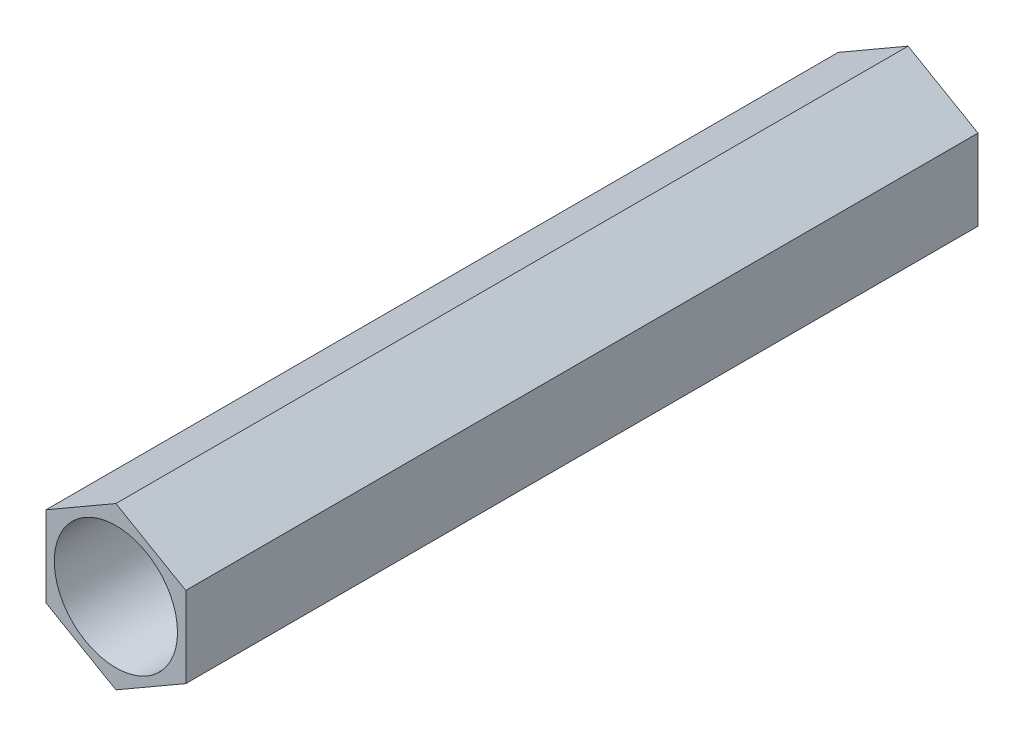
ISO-10303-21;
HEADER;
FILE_DESCRIPTION(('STEP AP214'),'2;1');
FILE_NAME('part.step','',(''),(''),'','','');
FILE_SCHEMA(('AUTOMOTIVE_DESIGN { 1 0 10303 214 1 1 1 1 }'));
ENDSEC;
DATA;
#1=APPLICATION_CONTEXT('core data for automotive mechanical design processes');
#2=APPLICATION_PROTOCOL_DEFINITION('international standard','automotive_design',2000,#1);
#3=PRODUCT_CONTEXT('',#1,'mechanical');
#4=PRODUCT('Part','Part','',(#3));
#5=PRODUCT_RELATED_PRODUCT_CATEGORY('part','',(#4));
#6=PRODUCT_DEFINITION_FORMATION('','',#4);
#7=PRODUCT_DEFINITION_CONTEXT('part definition',#1,'design');
#8=PRODUCT_DEFINITION('design','',#6,#7);
#9=PRODUCT_DEFINITION_SHAPE('','',#8);
#10=(LENGTH_UNIT() NAMED_UNIT(*) SI_UNIT(.MILLI.,.METRE.));
#11=(NAMED_UNIT(*) PLANE_ANGLE_UNIT() SI_UNIT($,.RADIAN.));
#12=(NAMED_UNIT(*) SI_UNIT($,.STERADIAN.) SOLID_ANGLE_UNIT());
#13=UNCERTAINTY_MEASURE_WITH_UNIT(LENGTH_MEASURE(1.E-05),#10,'distance_accuracy_value','');
#14=(GEOMETRIC_REPRESENTATION_CONTEXT(3) GLOBAL_UNCERTAINTY_ASSIGNED_CONTEXT((#13)) GLOBAL_UNIT_ASSIGNED_CONTEXT((#10,
#11,#12)) REPRESENTATION_CONTEXT('',''));
#15=CARTESIAN_POINT('',(0.,0.,0.));
#16=DIRECTION('',(0.,0.,1.));
#17=DIRECTION('',(1.,0.,0.));
#18=AXIS2_PLACEMENT_3D('',#15,#16,#17);
#19=CARTESIAN_POINT('',(0.,-2.75,27.));
#20=DIRECTION('',(0.,0.,1.));
#21=DIRECTION('',(1.,0.,0.));
#22=AXIS2_PLACEMENT_3D('',#19,#20,#21);
#23=PLANE('',#22);
#24=DIRECTION('',(0.866025403784438,-0.500000000000001,0.));
#25=VECTOR('',#24,1.);
#26=CARTESIAN_POINT('',(-2.38156986040721,-1.375,27.));
#27=LINE('',#26,#25);
#28=CARTESIAN_POINT('',(-2.38156986040721,-1.375,27.));
#29=VERTEX_POINT('',#28);
#30=CARTESIAN_POINT('',(0.,-2.75,27.));
#31=VERTEX_POINT('',#30);
#32=EDGE_CURVE('E128',#29,#31,#27,.T.);
#33=ORIENTED_EDGE('',*,*,#32,.T.);
#34=DIRECTION('',(0.866025403784439,0.5,0.));
#35=VECTOR('',#34,1.);
#36=CARTESIAN_POINT('',(0.,-2.75,27.));
#37=LINE('',#36,#35);
#38=CARTESIAN_POINT('',(2.3815698604072,-1.375,27.));
#39=VERTEX_POINT('',#38);
#40=EDGE_CURVE('E86',#31,#39,#37,.T.);
#41=ORIENTED_EDGE('',*,*,#40,.T.);
#42=DIRECTION('',(0.,1.,0.));
#43=VECTOR('',#42,1.);
#44=CARTESIAN_POINT('',(2.3815698604072,-1.375,27.));
#45=LINE('',#44,#43);
#46=CARTESIAN_POINT('',(2.3815698604072,1.375,27.));
#47=VERTEX_POINT('',#46);
#48=EDGE_CURVE('E99',#39,#47,#45,.T.);
#49=ORIENTED_EDGE('',*,*,#48,.T.);
#50=DIRECTION('',(-0.866025403784439,0.5,0.));
#51=VECTOR('',#50,1.);
#52=CARTESIAN_POINT('',(2.3815698604072,1.375,27.));
#53=LINE('',#52,#51);
#54=CARTESIAN_POINT('',(0.,2.75,27.));
#55=VERTEX_POINT('',#54);
#56=EDGE_CURVE('E93',#47,#55,#53,.T.);
#57=ORIENTED_EDGE('',*,*,#56,.T.);
#58=DIRECTION('',(-0.866025403784439,-0.499999999999999,0.));
#59=VECTOR('',#58,1.);
#60=CARTESIAN_POINT('',(0.,2.75,27.));
#61=LINE('',#60,#59);
#62=CARTESIAN_POINT('',(-2.3815698604072,1.375,27.));
#63=VERTEX_POINT('',#62);
#64=EDGE_CURVE('E97',#55,#63,#61,.T.);
#65=ORIENTED_EDGE('',*,*,#64,.T.);
#66=DIRECTION('',(0.,-1.,0.));
#67=VECTOR('',#66,1.);
#68=CARTESIAN_POINT('',(-2.3815698604072,1.375,27.));
#69=LINE('',#68,#67);
#70=EDGE_CURVE('E49',#63,#29,#69,.T.);
#71=ORIENTED_EDGE('',*,*,#70,.T.);
#72=EDGE_LOOP('',(#33,#41,#49,#57,#65,#71));
#73=FACE_BOUND('',#72,.T.);
#74=CARTESIAN_POINT('',(0.,0.,27.));
#75=DIRECTION('',(0.,0.,1.));
#76=DIRECTION('',(1.,0.,0.));
#77=AXIS2_PLACEMENT_3D('',#74,#75,#76);
#78=CIRCLE('',#77,2.1);
#79=CARTESIAN_POINT('',(2.1,0.,27.));
#80=VERTEX_POINT('',#79);
#81=EDGE_CURVE('E121',#80,#80,#78,.T.);
#82=ORIENTED_EDGE('',*,*,#81,.F.);
#83=EDGE_LOOP('',(#82));
#84=FACE_BOUND('',#83,.T.);
#85=ADVANCED_FACE('F32',(#73,#84),#23,.T.);
#86=CARTESIAN_POINT('',(0.,-2.75,0.));
#87=DIRECTION('',(0.,0.,1.));
#88=DIRECTION('',(1.,0.,0.));
#89=AXIS2_PLACEMENT_3D('',#86,#87,#88);
#90=PLANE('',#89);
#91=DIRECTION('',(0.866025403784438,-0.500000000000001,0.));
#92=VECTOR('',#91,1.);
#93=CARTESIAN_POINT('',(-2.38156986040721,-1.375,0.));
#94=LINE('',#93,#92);
#95=CARTESIAN_POINT('',(-2.38156986040721,-1.375,0.));
#96=VERTEX_POINT('',#95);
#97=CARTESIAN_POINT('',(0.,-2.75,0.));
#98=VERTEX_POINT('',#97);
#99=EDGE_CURVE('E117',#96,#98,#94,.T.);
#100=ORIENTED_EDGE('',*,*,#99,.F.);
#101=DIRECTION('',(0.,-1.,0.));
#102=VECTOR('',#101,1.);
#103=CARTESIAN_POINT('',(-2.3815698604072,1.375,0.));
#104=LINE('',#103,#102);
#105=CARTESIAN_POINT('',(-2.3815698604072,1.375,0.));
#106=VERTEX_POINT('',#105);
#107=EDGE_CURVE('E78',#106,#96,#104,.T.);
#108=ORIENTED_EDGE('',*,*,#107,.F.);
#109=DIRECTION('',(-0.866025403784439,-0.499999999999999,0.));
#110=VECTOR('',#109,1.);
#111=CARTESIAN_POINT('',(0.,2.75,0.));
#112=LINE('',#111,#110);
#113=CARTESIAN_POINT('',(0.,2.75,0.));
#114=VERTEX_POINT('',#113);
#115=EDGE_CURVE('E72',#114,#106,#112,.T.);
#116=ORIENTED_EDGE('',*,*,#115,.F.);
#117=DIRECTION('',(-0.866025403784439,0.5,0.));
#118=VECTOR('',#117,1.);
#119=CARTESIAN_POINT('',(2.3815698604072,1.375,0.));
#120=LINE('',#119,#118);
#121=CARTESIAN_POINT('',(2.3815698604072,1.375,0.));
#122=VERTEX_POINT('',#121);
#123=EDGE_CURVE('E107',#122,#114,#120,.T.);
#124=ORIENTED_EDGE('',*,*,#123,.F.);
#125=DIRECTION('',(0.,1.,0.));
#126=VECTOR('',#125,1.);
#127=CARTESIAN_POINT('',(2.3815698604072,-1.375,0.));
#128=LINE('',#127,#126);
#129=CARTESIAN_POINT('',(2.3815698604072,-1.375,0.));
#130=VERTEX_POINT('',#129);
#131=EDGE_CURVE('E123',#130,#122,#128,.T.);
#132=ORIENTED_EDGE('',*,*,#131,.F.);
#133=DIRECTION('',(0.866025403784439,0.5,0.));
#134=VECTOR('',#133,1.);
#135=CARTESIAN_POINT('',(0.,-2.75,0.));
#136=LINE('',#135,#134);
#137=EDGE_CURVE('E120',#98,#130,#136,.T.);
#138=ORIENTED_EDGE('',*,*,#137,.F.);
#139=EDGE_LOOP('',(#100,#108,#116,#124,#132,#138));
#140=FACE_BOUND('',#139,.T.);
#141=CARTESIAN_POINT('',(0.,0.,0.));
#142=DIRECTION('',(0.,0.,1.));
#143=DIRECTION('',(1.,0.,0.));
#144=AXIS2_PLACEMENT_3D('',#141,#142,#143);
#145=CIRCLE('',#144,2.1);
#146=CARTESIAN_POINT('',(2.1,0.,0.));
#147=VERTEX_POINT('',#146);
#148=EDGE_CURVE('E221',#147,#147,#145,.T.);
#149=ORIENTED_EDGE('',*,*,#148,.T.);
#150=EDGE_LOOP('',(#149));
#151=FACE_BOUND('',#150,.T.);
#152=ADVANCED_FACE('F137',(#140,#151),#90,.F.);
#153=CARTESIAN_POINT('',(-2.38156986040721,-1.375,27.));
#154=DIRECTION('',(0.500000000000001,0.866025403784438,0.));
#155=DIRECTION('',(-0.866025403784438,0.500000000000001,0.));
#156=AXIS2_PLACEMENT_3D('',#153,#154,#155);
#157=PLANE('',#156);
#158=ORIENTED_EDGE('',*,*,#99,.T.);
#159=DIRECTION('',(0.,0.,-1.));
#160=VECTOR('',#159,1.);
#161=CARTESIAN_POINT('',(0.,-2.75,27.));
#162=LINE('',#161,#160);
#163=EDGE_CURVE('E11',#31,#98,#162,.T.);
#164=ORIENTED_EDGE('',*,*,#163,.F.);
#165=ORIENTED_EDGE('',*,*,#32,.F.);
#166=DIRECTION('',(0.,0.,-1.));
#167=VECTOR('',#166,1.);
#168=CARTESIAN_POINT('',(-2.38156986040721,-1.375,27.));
#169=LINE('',#168,#167);
#170=EDGE_CURVE('E113',#29,#96,#169,.T.);
#171=ORIENTED_EDGE('',*,*,#170,.T.);
#172=EDGE_LOOP('',(#158,#164,#165,#171));
#173=FACE_BOUND('',#172,.T.);
#174=ADVANCED_FACE('F34',(#173),#157,.F.);
#175=CARTESIAN_POINT('',(0.,-2.75,27.));
#176=DIRECTION('',(-0.5,0.866025403784439,0.));
#177=DIRECTION('',(-0.866025403784439,-0.5,0.));
#178=AXIS2_PLACEMENT_3D('',#175,#176,#177);
#179=PLANE('',#178);
#180=ORIENTED_EDGE('',*,*,#137,.T.);
#181=DIRECTION('',(0.,0.,-1.));
#182=VECTOR('',#181,1.);
#183=CARTESIAN_POINT('',(2.3815698604072,-1.375,27.));
#184=LINE('',#183,#182);
#185=EDGE_CURVE('E41',#39,#130,#184,.T.);
#186=ORIENTED_EDGE('',*,*,#185,.F.);
#187=ORIENTED_EDGE('',*,*,#40,.F.);
#188=ORIENTED_EDGE('',*,*,#163,.T.);
#189=EDGE_LOOP('',(#180,#186,#187,#188));
#190=FACE_BOUND('',#189,.T.);
#191=ADVANCED_FACE('F162',(#190),#179,.F.);
#192=CARTESIAN_POINT('',(2.3815698604072,-1.375,27.));
#193=DIRECTION('',(-1.,0.,0.));
#194=DIRECTION('',(0.,0.,1.));
#195=AXIS2_PLACEMENT_3D('',#192,#193,#194);
#196=PLANE('',#195);
#197=ORIENTED_EDGE('',*,*,#131,.T.);
#198=DIRECTION('',(0.,0.,-1.));
#199=VECTOR('',#198,1.);
#200=CARTESIAN_POINT('',(2.3815698604072,1.375,27.));
#201=LINE('',#200,#199);
#202=EDGE_CURVE('E108',#47,#122,#201,.T.);
#203=ORIENTED_EDGE('',*,*,#202,.F.);
#204=ORIENTED_EDGE('',*,*,#48,.F.);
#205=ORIENTED_EDGE('',*,*,#185,.T.);
#206=EDGE_LOOP('',(#197,#203,#204,#205));
#207=FACE_BOUND('',#206,.T.);
#208=ADVANCED_FACE('F134',(#207),#196,.F.);
#209=CARTESIAN_POINT('',(2.3815698604072,1.375,27.));
#210=DIRECTION('',(-0.5,-0.866025403784439,0.));
#211=DIRECTION('',(0.866025403784439,-0.5,0.));
#212=AXIS2_PLACEMENT_3D('',#209,#210,#211);
#213=PLANE('',#212);
#214=ORIENTED_EDGE('',*,*,#123,.T.);
#215=DIRECTION('',(0.,0.,-1.));
#216=VECTOR('',#215,1.);
#217=CARTESIAN_POINT('',(0.,2.75,27.));
#218=LINE('',#217,#216);
#219=EDGE_CURVE('E104',#55,#114,#218,.T.);
#220=ORIENTED_EDGE('',*,*,#219,.F.);
#221=ORIENTED_EDGE('',*,*,#56,.F.);
#222=ORIENTED_EDGE('',*,*,#202,.T.);
#223=EDGE_LOOP('',(#214,#220,#221,#222));
#224=FACE_BOUND('',#223,.T.);
#225=ADVANCED_FACE('F105',(#224),#213,.F.);
#226=CARTESIAN_POINT('',(0.,2.75,27.));
#227=DIRECTION('',(0.499999999999999,-0.866025403784439,0.));
#228=DIRECTION('',(0.866025403784439,0.499999999999999,0.));
#229=AXIS2_PLACEMENT_3D('',#226,#227,#228);
#230=PLANE('',#229);
#231=ORIENTED_EDGE('',*,*,#115,.T.);
#232=DIRECTION('',(0.,0.,-1.));
#233=VECTOR('',#232,1.);
#234=CARTESIAN_POINT('',(-2.3815698604072,1.375,27.));
#235=LINE('',#234,#233);
#236=EDGE_CURVE('E109',#63,#106,#235,.T.);
#237=ORIENTED_EDGE('',*,*,#236,.F.);
#238=ORIENTED_EDGE('',*,*,#64,.F.);
#239=ORIENTED_EDGE('',*,*,#219,.T.);
#240=EDGE_LOOP('',(#231,#237,#238,#239));
#241=FACE_BOUND('',#240,.T.);
#242=ADVANCED_FACE('F111',(#241),#230,.F.);
#243=CARTESIAN_POINT('',(-2.3815698604072,1.375,27.));
#244=DIRECTION('',(1.,0.,0.));
#245=DIRECTION('',(0.,1.,0.));
#246=AXIS2_PLACEMENT_3D('',#243,#244,#245);
#247=PLANE('',#246);
#248=ORIENTED_EDGE('',*,*,#107,.T.);
#249=ORIENTED_EDGE('',*,*,#170,.F.);
#250=ORIENTED_EDGE('',*,*,#70,.F.);
#251=ORIENTED_EDGE('',*,*,#236,.T.);
#252=EDGE_LOOP('',(#248,#249,#250,#251));
#253=FACE_BOUND('',#252,.T.);
#254=ADVANCED_FACE('F142',(#253),#247,.F.);
#255=CARTESIAN_POINT('',(0.,0.,27.));
#256=DIRECTION('',(0.,0.,-1.));
#257=DIRECTION('',(-1.,0.,0.));
#258=AXIS2_PLACEMENT_3D('',#255,#256,#257);
#259=CYLINDRICAL_SURFACE('',#258,2.1);
#260=ORIENTED_EDGE('',*,*,#81,.T.);
#261=EDGE_LOOP('',(#260));
#262=FACE_BOUND('',#261,.T.);
#263=ORIENTED_EDGE('',*,*,#148,.F.);
#264=EDGE_LOOP('',(#263));
#265=FACE_BOUND('',#264,.T.);
#266=ADVANCED_FACE('F144',(#262,#265),#259,.F.);
#267=CLOSED_SHELL('',(#85,#152,#174,#191,#208,#225,#242,#254,#266));
#268=MANIFOLD_SOLID_BREP('B2',#267);
#269=ADVANCED_BREP_SHAPE_REPRESENTATION('',(#18,#268),#14);
#270=SHAPE_DEFINITION_REPRESENTATION(#9,#269);
ENDSEC;
END-ISO-10303-21;
